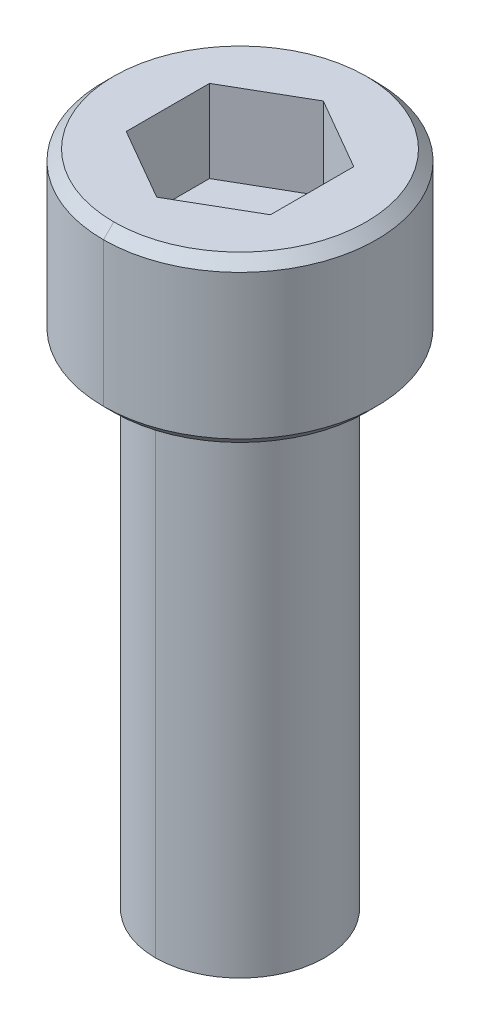
ISO-10303-21;
HEADER;
FILE_DESCRIPTION(('STEP AP214'),'2;1');
FILE_NAME('part.step','',(''),(''),'','','');
FILE_SCHEMA(('AUTOMOTIVE_DESIGN { 1 0 10303 214 1 1 1 1 }'));
ENDSEC;
DATA;
#1=APPLICATION_CONTEXT('core data for automotive mechanical design processes');
#2=APPLICATION_PROTOCOL_DEFINITION('international standard','automotive_design',2000,#1);
#3=PRODUCT_CONTEXT('',#1,'mechanical');
#4=PRODUCT('Part','Part','',(#3));
#5=PRODUCT_RELATED_PRODUCT_CATEGORY('part','',(#4));
#6=PRODUCT_DEFINITION_FORMATION('','',#4);
#7=PRODUCT_DEFINITION_CONTEXT('part definition',#1,'design');
#8=PRODUCT_DEFINITION('design','',#6,#7);
#9=PRODUCT_DEFINITION_SHAPE('','',#8);
#10=(LENGTH_UNIT() NAMED_UNIT(*) SI_UNIT(.MILLI.,.METRE.));
#11=(NAMED_UNIT(*) PLANE_ANGLE_UNIT() SI_UNIT($,.RADIAN.));
#12=(NAMED_UNIT(*) SI_UNIT($,.STERADIAN.) SOLID_ANGLE_UNIT());
#13=UNCERTAINTY_MEASURE_WITH_UNIT(LENGTH_MEASURE(1.E-05),#10,'distance_accuracy_value','');
#14=(GEOMETRIC_REPRESENTATION_CONTEXT(3) GLOBAL_UNCERTAINTY_ASSIGNED_CONTEXT((#13)) GLOBAL_UNIT_ASSIGNED_CONTEXT((#10,
#11,#12)) REPRESENTATION_CONTEXT('',''));
#15=CARTESIAN_POINT('',(0.,0.,0.));
#16=DIRECTION('',(0.,0.,1.));
#17=DIRECTION('',(1.,0.,0.));
#18=AXIS2_PLACEMENT_3D('',#15,#16,#17);
#19=CARTESIAN_POINT('',(0.,-12.16152,0.));
#20=DIRECTION('',(0.,1.,0.));
#21=DIRECTION('',(0.,0.,1.));
#22=AXIS2_PLACEMENT_3D('',#19,#20,#21);
#23=CONICAL_SURFACE('',#22,2.0828,0.960291895410485);
#24=DIRECTION('',(0.,0.573280843383967,-0.819358941251615));
#25=VECTOR('',#24,1.);
#26=CARTESIAN_POINT('',(0.,-12.16152,-2.0828));
#27=LINE('',#26,#25);
#28=CARTESIAN_POINT('',(0.,-12.7,-1.31318));
#29=VERTEX_POINT('',#28);
#30=CARTESIAN_POINT('',(0.,-12.16152,-2.0828));
#31=VERTEX_POINT('',#30);
#32=EDGE_CURVE('E243',#29,#31,#27,.T.);
#33=ORIENTED_EDGE('',*,*,#32,.F.);
#34=CARTESIAN_POINT('',(0.,-12.7,0.));
#35=DIRECTION('',(0.,-1.,0.));
#36=DIRECTION('',(0.,0.,1.));
#37=AXIS2_PLACEMENT_3D('',#34,#35,#36);
#38=CIRCLE('',#37,1.31318);
#39=CARTESIAN_POINT('',(0.,-12.7,1.31318));
#40=VERTEX_POINT('',#39);
#41=EDGE_CURVE('E261',#40,#29,#38,.T.);
#42=ORIENTED_EDGE('',*,*,#41,.F.);
#43=DIRECTION('',(0.,0.573280843383967,0.819358941251615));
#44=VECTOR('',#43,1.);
#45=CARTESIAN_POINT('',(0.,-12.16152,2.0828));
#46=LINE('',#45,#44);
#47=CARTESIAN_POINT('',(0.,-12.16152,2.0828));
#48=VERTEX_POINT('',#47);
#49=EDGE_CURVE('E175',#40,#48,#46,.T.);
#50=ORIENTED_EDGE('',*,*,#49,.T.);
#51=CARTESIAN_POINT('',(0.,-12.16152,0.));
#52=DIRECTION('',(0.,1.,0.));
#53=DIRECTION('',(0.,0.,1.));
#54=AXIS2_PLACEMENT_3D('',#51,#52,#53);
#55=CIRCLE('',#54,2.0828);
#56=EDGE_CURVE('E189',#31,#48,#55,.T.);
#57=ORIENTED_EDGE('',*,*,#56,.F.);
#58=EDGE_LOOP('',(#33,#42,#50,#57));
#59=FACE_BOUND('',#58,.T.);
#60=ADVANCED_FACE('F16',(#59),#23,.T.);
#61=CARTESIAN_POINT('',(0.,0.254000000000004,0.));
#62=DIRECTION('',(0.,1.,0.));
#63=DIRECTION('',(0.,0.,1.));
#64=AXIS2_PLACEMENT_3D('',#61,#62,#63);
#65=CONICAL_SURFACE('',#64,3.3655,0.78539816339745);
#66=DIRECTION('',(0.,0.707106781186546,-0.707106781186549));
#67=VECTOR('',#66,1.);
#68=CARTESIAN_POINT('',(0.,0.254000000000004,-3.3655));
#69=LINE('',#68,#67);
#70=CARTESIAN_POINT('',(0.,0.,-3.1115));
#71=VERTEX_POINT('',#70);
#72=CARTESIAN_POINT('',(0.,0.254000000000004,-3.3655));
#73=VERTEX_POINT('',#72);
#74=EDGE_CURVE('E20',#71,#73,#69,.T.);
#75=ORIENTED_EDGE('',*,*,#74,.F.);
#76=CARTESIAN_POINT('',(0.,0.,0.));
#77=DIRECTION('',(0.,-1.,0.));
#78=DIRECTION('',(0.,0.,1.));
#79=AXIS2_PLACEMENT_3D('',#76,#77,#78);
#80=CIRCLE('',#79,3.1115);
#81=CARTESIAN_POINT('',(0.,0.,3.1115));
#82=VERTEX_POINT('',#81);
#83=EDGE_CURVE('E153',#82,#71,#80,.T.);
#84=ORIENTED_EDGE('',*,*,#83,.F.);
#85=DIRECTION('',(0.,0.707106781186546,0.707106781186549));
#86=VECTOR('',#85,1.);
#87=CARTESIAN_POINT('',(0.,0.254000000000004,3.3655));
#88=LINE('',#87,#86);
#89=CARTESIAN_POINT('',(0.,0.254000000000004,3.3655));
#90=VERTEX_POINT('',#89);
#91=EDGE_CURVE('E156',#82,#90,#88,.T.);
#92=ORIENTED_EDGE('',*,*,#91,.T.);
#93=CARTESIAN_POINT('',(0.,0.254000000000004,0.));
#94=DIRECTION('',(0.,1.,0.));
#95=DIRECTION('',(0.,0.,1.));
#96=AXIS2_PLACEMENT_3D('',#93,#94,#95);
#97=CIRCLE('',#96,3.3655);
#98=EDGE_CURVE('E254',#73,#90,#97,.T.);
#99=ORIENTED_EDGE('',*,*,#98,.F.);
#100=EDGE_LOOP('',(#75,#84,#92,#99));
#101=FACE_BOUND('',#100,.T.);
#102=ADVANCED_FACE('F155',(#101),#65,.T.);
#103=CARTESIAN_POINT('',(0.,4.064,0.));
#104=DIRECTION('',(0.,-1.,0.));
#105=DIRECTION('',(0.,0.,-1.));
#106=AXIS2_PLACEMENT_3D('',#103,#104,#105);
#107=CONICAL_SURFACE('',#106,3.1115,0.785398163397446);
#108=DIRECTION('',(0.,-0.707106781186549,0.707106781186546));
#109=VECTOR('',#108,1.);
#110=CARTESIAN_POINT('',(0.,4.064,3.1115));
#111=LINE('',#110,#109);
#112=CARTESIAN_POINT('',(0.,4.064,3.1115));
#113=VERTEX_POINT('',#112);
#114=CARTESIAN_POINT('',(0.,3.81,3.3655));
#115=VERTEX_POINT('',#114);
#116=EDGE_CURVE('E204',#113,#115,#111,.T.);
#117=ORIENTED_EDGE('',*,*,#116,.F.);
#118=CARTESIAN_POINT('',(0.,4.064,0.));
#119=DIRECTION('',(0.,1.,0.));
#120=DIRECTION('',(0.,0.,1.));
#121=AXIS2_PLACEMENT_3D('',#118,#119,#120);
#122=CIRCLE('',#121,3.1115);
#123=CARTESIAN_POINT('',(0.,4.064,-3.1115));
#124=VERTEX_POINT('',#123);
#125=EDGE_CURVE('E240',#124,#113,#122,.T.);
#126=ORIENTED_EDGE('',*,*,#125,.F.);
#127=DIRECTION('',(0.,-0.707106781186549,-0.707106781186546));
#128=VECTOR('',#127,1.);
#129=CARTESIAN_POINT('',(0.,4.064,-3.1115));
#130=LINE('',#129,#128);
#131=CARTESIAN_POINT('',(0.,3.81,-3.3655));
#132=VERTEX_POINT('',#131);
#133=EDGE_CURVE('E232',#124,#132,#130,.T.);
#134=ORIENTED_EDGE('',*,*,#133,.T.);
#135=CARTESIAN_POINT('',(0.,3.81,0.));
#136=DIRECTION('',(0.,-1.,0.));
#137=DIRECTION('',(0.,0.,1.));
#138=AXIS2_PLACEMENT_3D('',#135,#136,#137);
#139=CIRCLE('',#138,3.3655);
#140=EDGE_CURVE('E258',#115,#132,#139,.T.);
#141=ORIENTED_EDGE('',*,*,#140,.F.);
#142=EDGE_LOOP('',(#117,#126,#134,#141));
#143=FACE_BOUND('',#142,.T.);
#144=ADVANCED_FACE('F325',(#143),#107,.T.);
#145=CARTESIAN_POINT('',(1.778,2.032,3.07958633585744));
#146=DIRECTION('',(0.,1.,0.));
#147=DIRECTION('',(0.,0.,-1.));
#148=AXIS2_PLACEMENT_3D('',#145,#146,#147);
#149=PLANE('',#148);
#150=DIRECTION('',(0.866025403784439,0.,0.5));
#151=VECTOR('',#150,1.);
#152=CARTESIAN_POINT('',(-1.778,2.032,1.02652877861915));
#153=LINE('',#152,#151);
#154=CARTESIAN_POINT('',(-1.778,2.032,1.02652877861915));
#155=VERTEX_POINT('',#154);
#156=CARTESIAN_POINT('',(0.,2.032,2.05305755723831));
#157=VERTEX_POINT('',#156);
#158=EDGE_CURVE('E226',#155,#157,#153,.T.);
#159=ORIENTED_EDGE('',*,*,#158,.T.);
#160=DIRECTION('',(0.866025403784439,0.,-0.5));
#161=VECTOR('',#160,1.);
#162=CARTESIAN_POINT('',(0.,2.032,2.05305755723831));
#163=LINE('',#162,#161);
#164=CARTESIAN_POINT('',(1.778,2.032,1.02652877861915));
#165=VERTEX_POINT('',#164);
#166=EDGE_CURVE('E11',#157,#165,#163,.T.);
#167=ORIENTED_EDGE('',*,*,#166,.T.);
#168=DIRECTION('',(0.,0.,-1.));
#169=VECTOR('',#168,1.);
#170=CARTESIAN_POINT('',(1.778,2.032,1.02652877861915));
#171=LINE('',#170,#169);
#172=CARTESIAN_POINT('',(1.778,2.032,-1.02652877861916));
#173=VERTEX_POINT('',#172);
#174=EDGE_CURVE('E211',#165,#173,#171,.T.);
#175=ORIENTED_EDGE('',*,*,#174,.T.);
#176=DIRECTION('',(-0.866025403784439,0.,-0.5));
#177=VECTOR('',#176,1.);
#178=CARTESIAN_POINT('',(1.778,2.032,-1.02652877861916));
#179=LINE('',#178,#177);
#180=CARTESIAN_POINT('',(0.,2.032,-2.05305755723829));
#181=VERTEX_POINT('',#180);
#182=EDGE_CURVE('E199',#173,#181,#179,.T.);
#183=ORIENTED_EDGE('',*,*,#182,.T.);
#184=DIRECTION('',(-0.866025403784439,0.,0.5));
#185=VECTOR('',#184,1.);
#186=CARTESIAN_POINT('',(0.,2.032,-2.05305755723829));
#187=LINE('',#186,#185);
#188=CARTESIAN_POINT('',(-1.778,2.032,-1.02652877861915));
#189=VERTEX_POINT('',#188);
#190=EDGE_CURVE('E212',#181,#189,#187,.T.);
#191=ORIENTED_EDGE('',*,*,#190,.T.);
#192=DIRECTION('',(0.,0.,1.));
#193=VECTOR('',#192,1.);
#194=CARTESIAN_POINT('',(-1.778,2.032,-1.02652877861915));
#195=LINE('',#194,#193);
#196=EDGE_CURVE('E221',#189,#155,#195,.T.);
#197=ORIENTED_EDGE('',*,*,#196,.T.);
#198=EDGE_LOOP('',(#159,#167,#175,#183,#191,#197));
#199=FACE_BOUND('',#198,.T.);
#200=ADVANCED_FACE('F556',(#199),#149,.T.);
#201=CARTESIAN_POINT('',(0.,2.032,2.05305755723831));
#202=DIRECTION('',(0.5,0.,0.866025403784439));
#203=DIRECTION('',(0.,-1.,0.));
#204=AXIS2_PLACEMENT_3D('',#201,#202,#203);
#205=PLANE('',#204);
#206=DIRECTION('',(0.866025403784439,0.,-0.5));
#207=VECTOR('',#206,1.);
#208=CARTESIAN_POINT('',(0.,4.064,2.05305755723831));
#209=LINE('',#208,#207);
#210=CARTESIAN_POINT('',(0.,4.064,2.05305755723831));
#211=VERTEX_POINT('',#210);
#212=CARTESIAN_POINT('',(1.778,4.064,1.02652877861915));
#213=VERTEX_POINT('',#212);
#214=EDGE_CURVE('E163',#211,#213,#209,.T.);
#215=ORIENTED_EDGE('',*,*,#214,.T.);
#216=DIRECTION('',(0.,1.,0.));
#217=VECTOR('',#216,1.);
#218=CARTESIAN_POINT('',(1.778,2.032,1.02652877861915));
#219=LINE('',#218,#217);
#220=EDGE_CURVE('E27',#165,#213,#219,.T.);
#221=ORIENTED_EDGE('',*,*,#220,.F.);
#222=ORIENTED_EDGE('',*,*,#166,.F.);
#223=DIRECTION('',(0.,1.,0.));
#224=VECTOR('',#223,1.);
#225=CARTESIAN_POINT('',(0.,2.032,2.05305755723831));
#226=LINE('',#225,#224);
#227=EDGE_CURVE('E115',#157,#211,#226,.T.);
#228=ORIENTED_EDGE('',*,*,#227,.T.);
#229=EDGE_LOOP('',(#215,#221,#222,#228));
#230=FACE_BOUND('',#229,.T.);
#231=ADVANCED_FACE('F550',(#230),#205,.F.);
#232=CARTESIAN_POINT('',(1.778,2.032,1.02652877861915));
#233=DIRECTION('',(1.,0.,0.));
#234=DIRECTION('',(0.,0.,-1.));
#235=AXIS2_PLACEMENT_3D('',#232,#233,#234);
#236=PLANE('',#235);
#237=DIRECTION('',(0.,0.,-1.));
#238=VECTOR('',#237,1.);
#239=CARTESIAN_POINT('',(1.778,4.064,1.02652877861915));
#240=LINE('',#239,#238);
#241=CARTESIAN_POINT('',(1.778,4.064,-1.02652877861916));
#242=VERTEX_POINT('',#241);
#243=EDGE_CURVE('E194',#213,#242,#240,.T.);
#244=ORIENTED_EDGE('',*,*,#243,.T.);
#245=DIRECTION('',(0.,1.,0.));
#246=VECTOR('',#245,1.);
#247=CARTESIAN_POINT('',(1.778,2.032,-1.02652877861916));
#248=LINE('',#247,#246);
#249=EDGE_CURVE('E202',#173,#242,#248,.T.);
#250=ORIENTED_EDGE('',*,*,#249,.F.);
#251=ORIENTED_EDGE('',*,*,#174,.F.);
#252=ORIENTED_EDGE('',*,*,#220,.T.);
#253=EDGE_LOOP('',(#244,#250,#251,#252));
#254=FACE_BOUND('',#253,.T.);
#255=ADVANCED_FACE('F555',(#254),#236,.F.);
#256=CARTESIAN_POINT('',(1.778,2.032,-1.02652877861916));
#257=DIRECTION('',(0.5,0.,-0.866025403784439));
#258=DIRECTION('',(0.,-1.,0.));
#259=AXIS2_PLACEMENT_3D('',#256,#257,#258);
#260=PLANE('',#259);
#261=DIRECTION('',(-0.866025403784439,0.,-0.5));
#262=VECTOR('',#261,1.);
#263=CARTESIAN_POINT('',(1.778,4.064,-1.02652877861916));
#264=LINE('',#263,#262);
#265=CARTESIAN_POINT('',(0.,4.064,-2.05305755723829));
#266=VERTEX_POINT('',#265);
#267=EDGE_CURVE('E198',#242,#266,#264,.T.);
#268=ORIENTED_EDGE('',*,*,#267,.T.);
#269=DIRECTION('',(0.,1.,0.));
#270=VECTOR('',#269,1.);
#271=CARTESIAN_POINT('',(0.,2.032,-2.05305755723829));
#272=LINE('',#271,#270);
#273=EDGE_CURVE('E203',#181,#266,#272,.T.);
#274=ORIENTED_EDGE('',*,*,#273,.F.);
#275=ORIENTED_EDGE('',*,*,#182,.F.);
#276=ORIENTED_EDGE('',*,*,#249,.T.);
#277=EDGE_LOOP('',(#268,#274,#275,#276));
#278=FACE_BOUND('',#277,.T.);
#279=ADVANCED_FACE('F589',(#278),#260,.F.);
#280=CARTESIAN_POINT('',(0.,2.032,-2.05305755723829));
#281=DIRECTION('',(-0.5,0.,-0.866025403784439));
#282=DIRECTION('',(-0.866025403784439,0.,0.5));
#283=AXIS2_PLACEMENT_3D('',#280,#281,#282);
#284=PLANE('',#283);
#285=DIRECTION('',(-0.866025403784439,0.,0.5));
#286=VECTOR('',#285,1.);
#287=CARTESIAN_POINT('',(0.,4.064,-2.05305755723829));
#288=LINE('',#287,#286);
#289=CARTESIAN_POINT('',(-1.778,4.064,-1.02652877861915));
#290=VERTEX_POINT('',#289);
#291=EDGE_CURVE('E247',#266,#290,#288,.T.);
#292=ORIENTED_EDGE('',*,*,#291,.T.);
#293=DIRECTION('',(0.,1.,0.));
#294=VECTOR('',#293,1.);
#295=CARTESIAN_POINT('',(-1.778,2.032,-1.02652877861915));
#296=LINE('',#295,#294);
#297=EDGE_CURVE('E127',#189,#290,#296,.T.);
#298=ORIENTED_EDGE('',*,*,#297,.F.);
#299=ORIENTED_EDGE('',*,*,#190,.F.);
#300=ORIENTED_EDGE('',*,*,#273,.T.);
#301=EDGE_LOOP('',(#292,#298,#299,#300));
#302=FACE_BOUND('',#301,.T.);
#303=ADVANCED_FACE('F569',(#302),#284,.F.);
#304=CARTESIAN_POINT('',(-1.778,2.032,-1.02652877861915));
#305=DIRECTION('',(-1.,0.,0.));
#306=DIRECTION('',(0.,1.,0.));
#307=AXIS2_PLACEMENT_3D('',#304,#305,#306);
#308=PLANE('',#307);
#309=DIRECTION('',(0.,0.,1.));
#310=VECTOR('',#309,1.);
#311=CARTESIAN_POINT('',(-1.778,4.064,-1.02652877861915));
#312=LINE('',#311,#310);
#313=CARTESIAN_POINT('',(-1.778,4.064,1.02652877861915));
#314=VERTEX_POINT('',#313);
#315=EDGE_CURVE('E239',#290,#314,#312,.T.);
#316=ORIENTED_EDGE('',*,*,#315,.T.);
#317=DIRECTION('',(0.,1.,0.));
#318=VECTOR('',#317,1.);
#319=CARTESIAN_POINT('',(-1.778,2.032,1.02652877861915));
#320=LINE('',#319,#318);
#321=EDGE_CURVE('E105',#155,#314,#320,.T.);
#322=ORIENTED_EDGE('',*,*,#321,.F.);
#323=ORIENTED_EDGE('',*,*,#196,.F.);
#324=ORIENTED_EDGE('',*,*,#297,.T.);
#325=EDGE_LOOP('',(#316,#322,#323,#324));
#326=FACE_BOUND('',#325,.T.);
#327=ADVANCED_FACE('F564',(#326),#308,.F.);
#328=CARTESIAN_POINT('',(-1.778,2.032,1.02652877861915));
#329=DIRECTION('',(-0.5,0.,0.866025403784439));
#330=DIRECTION('',(0.,1.,0.));
#331=AXIS2_PLACEMENT_3D('',#328,#329,#330);
#332=PLANE('',#331);
#333=DIRECTION('',(0.866025403784439,0.,0.5));
#334=VECTOR('',#333,1.);
#335=CARTESIAN_POINT('',(-1.778,4.064,1.02652877861915));
#336=LINE('',#335,#334);
#337=EDGE_CURVE('E236',#314,#211,#336,.T.);
#338=ORIENTED_EDGE('',*,*,#337,.T.);
#339=ORIENTED_EDGE('',*,*,#227,.F.);
#340=ORIENTED_EDGE('',*,*,#158,.F.);
#341=ORIENTED_EDGE('',*,*,#321,.T.);
#342=EDGE_LOOP('',(#338,#339,#340,#341));
#343=FACE_BOUND('',#342,.T.);
#344=ADVANCED_FACE('F18',(#343),#332,.F.);
#345=CARTESIAN_POINT('',(0.,0.,0.));
#346=DIRECTION('',(0.,1.,0.));
#347=DIRECTION('',(0.,0.,-1.));
#348=AXIS2_PLACEMENT_3D('',#345,#346,#347);
#349=PLANE('',#348);
#350=CARTESIAN_POINT('',(0.,0.,0.));
#351=DIRECTION('',(0.,1.,0.));
#352=DIRECTION('',(0.,0.,1.));
#353=AXIS2_PLACEMENT_3D('',#350,#351,#352);
#354=CIRCLE('',#353,2.0828);
#355=CARTESIAN_POINT('',(0.,0.,2.0828));
#356=VERTEX_POINT('',#355);
#357=CARTESIAN_POINT('',(0.,0.,-2.0828));
#358=VERTEX_POINT('',#357);
#359=EDGE_CURVE('E220',#356,#358,#354,.T.);
#360=ORIENTED_EDGE('',*,*,#359,.T.);
#361=CARTESIAN_POINT('',(0.,0.,0.));
#362=DIRECTION('',(0.,1.,0.));
#363=DIRECTION('',(0.,0.,1.));
#364=AXIS2_PLACEMENT_3D('',#361,#362,#363);
#365=CIRCLE('',#364,2.0828);
#366=EDGE_CURVE('E192',#358,#356,#365,.T.);
#367=ORIENTED_EDGE('',*,*,#366,.T.);
#368=EDGE_LOOP('',(#360,#367));
#369=FACE_BOUND('',#368,.T.);
#370=ORIENTED_EDGE('',*,*,#83,.T.);
#371=CARTESIAN_POINT('',(0.,0.,0.));
#372=DIRECTION('',(0.,-1.,0.));
#373=DIRECTION('',(0.,0.,1.));
#374=AXIS2_PLACEMENT_3D('',#371,#372,#373);
#375=CIRCLE('',#374,3.1115);
#376=EDGE_CURVE('E167',#71,#82,#375,.T.);
#377=ORIENTED_EDGE('',*,*,#376,.T.);
#378=EDGE_LOOP('',(#370,#377));
#379=FACE_BOUND('',#378,.T.);
#380=ADVANCED_FACE('F173',(#369,#379),#349,.F.);
#381=CARTESIAN_POINT('',(0.,4.064,0.));
#382=DIRECTION('',(0.,1.,0.));
#383=DIRECTION('',(0.,0.,-1.));
#384=AXIS2_PLACEMENT_3D('',#381,#382,#383);
#385=PLANE('',#384);
#386=ORIENTED_EDGE('',*,*,#337,.F.);
#387=ORIENTED_EDGE('',*,*,#315,.F.);
#388=ORIENTED_EDGE('',*,*,#291,.F.);
#389=ORIENTED_EDGE('',*,*,#267,.F.);
#390=ORIENTED_EDGE('',*,*,#243,.F.);
#391=ORIENTED_EDGE('',*,*,#214,.F.);
#392=EDGE_LOOP('',(#386,#387,#388,#389,#390,#391));
#393=FACE_BOUND('',#392,.T.);
#394=ORIENTED_EDGE('',*,*,#125,.T.);
#395=CARTESIAN_POINT('',(0.,4.064,0.));
#396=DIRECTION('',(0.,1.,0.));
#397=DIRECTION('',(0.,0.,1.));
#398=AXIS2_PLACEMENT_3D('',#395,#396,#397);
#399=CIRCLE('',#398,3.1115);
#400=EDGE_CURVE('E171',#113,#124,#399,.T.);
#401=ORIENTED_EDGE('',*,*,#400,.T.);
#402=EDGE_LOOP('',(#394,#401));
#403=FACE_BOUND('',#402,.T.);
#404=ADVANCED_FACE('F321',(#393,#403),#385,.T.);
#405=CARTESIAN_POINT('',(0.,4.064,0.));
#406=DIRECTION('',(0.,-1.,0.));
#407=DIRECTION('',(0.,0.,-1.));
#408=AXIS2_PLACEMENT_3D('',#405,#406,#407);
#409=CYLINDRICAL_SURFACE('',#408,3.3655);
#410=DIRECTION('',(0.,-1.,0.));
#411=VECTOR('',#410,1.);
#412=CARTESIAN_POINT('',(0.,4.064,3.3655));
#413=LINE('',#412,#411);
#414=EDGE_CURVE('E227',#115,#90,#413,.T.);
#415=ORIENTED_EDGE('',*,*,#414,.F.);
#416=ORIENTED_EDGE('',*,*,#140,.T.);
#417=DIRECTION('',(0.,-1.,0.));
#418=VECTOR('',#417,1.);
#419=CARTESIAN_POINT('',(0.,4.064,-3.3655));
#420=LINE('',#419,#418);
#421=EDGE_CURVE('E231',#132,#73,#420,.T.);
#422=ORIENTED_EDGE('',*,*,#421,.T.);
#423=ORIENTED_EDGE('',*,*,#98,.T.);
#424=EDGE_LOOP('',(#415,#416,#422,#423));
#425=FACE_BOUND('',#424,.T.);
#426=ADVANCED_FACE('F296',(#425),#409,.T.);
#427=CARTESIAN_POINT('',(0.,-12.7,0.));
#428=DIRECTION('',(0.,1.,0.));
#429=DIRECTION('',(0.,0.,-1.));
#430=AXIS2_PLACEMENT_3D('',#427,#428,#429);
#431=PLANE('',#430);
#432=ORIENTED_EDGE('',*,*,#41,.T.);
#433=CARTESIAN_POINT('',(0.,-12.7,0.));
#434=DIRECTION('',(0.,-1.,0.));
#435=DIRECTION('',(0.,0.,1.));
#436=AXIS2_PLACEMENT_3D('',#433,#434,#435);
#437=CIRCLE('',#436,1.31318);
#438=EDGE_CURVE('E187',#29,#40,#437,.T.);
#439=ORIENTED_EDGE('',*,*,#438,.T.);
#440=EDGE_LOOP('',(#432,#439));
#441=FACE_BOUND('',#440,.T.);
#442=ADVANCED_FACE('F693',(#441),#431,.F.);
#443=CARTESIAN_POINT('',(0.,-12.7,0.));
#444=DIRECTION('',(0.,1.,0.));
#445=DIRECTION('',(0.,0.,1.));
#446=AXIS2_PLACEMENT_3D('',#443,#444,#445);
#447=CYLINDRICAL_SURFACE('',#446,2.0828);
#448=DIRECTION('',(0.,1.,0.));
#449=VECTOR('',#448,1.);
#450=CARTESIAN_POINT('',(0.,-12.7,-2.0828));
#451=LINE('',#450,#449);
#452=EDGE_CURVE('E253',#31,#358,#451,.T.);
#453=ORIENTED_EDGE('',*,*,#452,.F.);
#454=ORIENTED_EDGE('',*,*,#56,.T.);
#455=DIRECTION('',(0.,1.,0.));
#456=VECTOR('',#455,1.);
#457=CARTESIAN_POINT('',(0.,-12.7,2.0828));
#458=LINE('',#457,#456);
#459=EDGE_CURVE('E193',#48,#356,#458,.T.);
#460=ORIENTED_EDGE('',*,*,#459,.T.);
#461=ORIENTED_EDGE('',*,*,#366,.F.);
#462=EDGE_LOOP('',(#453,#454,#460,#461));
#463=FACE_BOUND('',#462,.T.);
#464=ADVANCED_FACE('F347',(#463),#447,.T.);
#465=CARTESIAN_POINT('',(0.,-12.7,0.));
#466=DIRECTION('',(0.,1.,0.));
#467=DIRECTION('',(0.,0.,1.));
#468=AXIS2_PLACEMENT_3D('',#465,#466,#467);
#469=CYLINDRICAL_SURFACE('',#468,2.0828);
#470=CARTESIAN_POINT('',(0.,-12.16152,0.));
#471=DIRECTION('',(0.,1.,0.));
#472=DIRECTION('',(0.,0.,1.));
#473=AXIS2_PLACEMENT_3D('',#470,#471,#472);
#474=CIRCLE('',#473,2.0828);
#475=EDGE_CURVE('E183',#48,#31,#474,.T.);
#476=ORIENTED_EDGE('',*,*,#475,.T.);
#477=ORIENTED_EDGE('',*,*,#452,.T.);
#478=ORIENTED_EDGE('',*,*,#359,.F.);
#479=ORIENTED_EDGE('',*,*,#459,.F.);
#480=EDGE_LOOP('',(#476,#477,#478,#479));
#481=FACE_BOUND('',#480,.T.);
#482=ADVANCED_FACE('F350',(#481),#469,.T.);
#483=CARTESIAN_POINT('',(0.,4.064,0.));
#484=DIRECTION('',(0.,-1.,0.));
#485=DIRECTION('',(0.,0.,-1.));
#486=AXIS2_PLACEMENT_3D('',#483,#484,#485);
#487=CYLINDRICAL_SURFACE('',#486,3.3655);
#488=CARTESIAN_POINT('',(0.,3.81,0.));
#489=DIRECTION('',(0.,-1.,0.));
#490=DIRECTION('',(0.,0.,1.));
#491=AXIS2_PLACEMENT_3D('',#488,#489,#490);
#492=CIRCLE('',#491,3.3655);
#493=EDGE_CURVE('E208',#132,#115,#492,.T.);
#494=ORIENTED_EDGE('',*,*,#493,.T.);
#495=ORIENTED_EDGE('',*,*,#414,.T.);
#496=CARTESIAN_POINT('',(0.,0.254000000000004,0.));
#497=DIRECTION('',(0.,1.,0.));
#498=DIRECTION('',(0.,0.,1.));
#499=AXIS2_PLACEMENT_3D('',#496,#497,#498);
#500=CIRCLE('',#499,3.3655);
#501=EDGE_CURVE('E169',#90,#73,#500,.T.);
#502=ORIENTED_EDGE('',*,*,#501,.T.);
#503=ORIENTED_EDGE('',*,*,#421,.F.);
#504=EDGE_LOOP('',(#494,#495,#502,#503));
#505=FACE_BOUND('',#504,.T.);
#506=ADVANCED_FACE('F299',(#505),#487,.T.);
#507=CARTESIAN_POINT('',(0.,4.064,0.));
#508=DIRECTION('',(0.,-1.,0.));
#509=DIRECTION('',(0.,0.,-1.));
#510=AXIS2_PLACEMENT_3D('',#507,#508,#509);
#511=CONICAL_SURFACE('',#510,3.1115,0.785398163397446);
#512=ORIENTED_EDGE('',*,*,#400,.F.);
#513=ORIENTED_EDGE('',*,*,#116,.T.);
#514=ORIENTED_EDGE('',*,*,#493,.F.);
#515=ORIENTED_EDGE('',*,*,#133,.F.);
#516=EDGE_LOOP('',(#512,#513,#514,#515));
#517=FACE_BOUND('',#516,.T.);
#518=ADVANCED_FACE('F328',(#517),#511,.T.);
#519=CARTESIAN_POINT('',(0.,0.254000000000004,0.));
#520=DIRECTION('',(0.,1.,0.));
#521=DIRECTION('',(0.,0.,1.));
#522=AXIS2_PLACEMENT_3D('',#519,#520,#521);
#523=CONICAL_SURFACE('',#522,3.3655,0.78539816339745);
#524=ORIENTED_EDGE('',*,*,#376,.F.);
#525=ORIENTED_EDGE('',*,*,#74,.T.);
#526=ORIENTED_EDGE('',*,*,#501,.F.);
#527=ORIENTED_EDGE('',*,*,#91,.F.);
#528=EDGE_LOOP('',(#524,#525,#526,#527));
#529=FACE_BOUND('',#528,.T.);
#530=ADVANCED_FACE('F166',(#529),#523,.T.);
#531=CARTESIAN_POINT('',(0.,-12.16152,0.));
#532=DIRECTION('',(0.,1.,0.));
#533=DIRECTION('',(0.,0.,1.));
#534=AXIS2_PLACEMENT_3D('',#531,#532,#533);
#535=CONICAL_SURFACE('',#534,2.0828,0.960291895410485);
#536=ORIENTED_EDGE('',*,*,#438,.F.);
#537=ORIENTED_EDGE('',*,*,#32,.T.);
#538=ORIENTED_EDGE('',*,*,#475,.F.);
#539=ORIENTED_EDGE('',*,*,#49,.F.);
#540=EDGE_LOOP('',(#536,#537,#538,#539));
#541=FACE_BOUND('',#540,.T.);
#542=ADVANCED_FACE('F352',(#541),#535,.T.);
#543=CLOSED_SHELL('',(#60,#102,#144,#200,#231,#255,#279,#303,#327,#344,#380,#404,#426,#442,#464,
#482,#506,#518,#530,#542));
#544=MANIFOLD_SOLID_BREP('B1',#543);
#545=ADVANCED_BREP_SHAPE_REPRESENTATION('',(#18,#544),#14);
#546=SHAPE_DEFINITION_REPRESENTATION(#9,#545);
ENDSEC;
END-ISO-10303-21;
